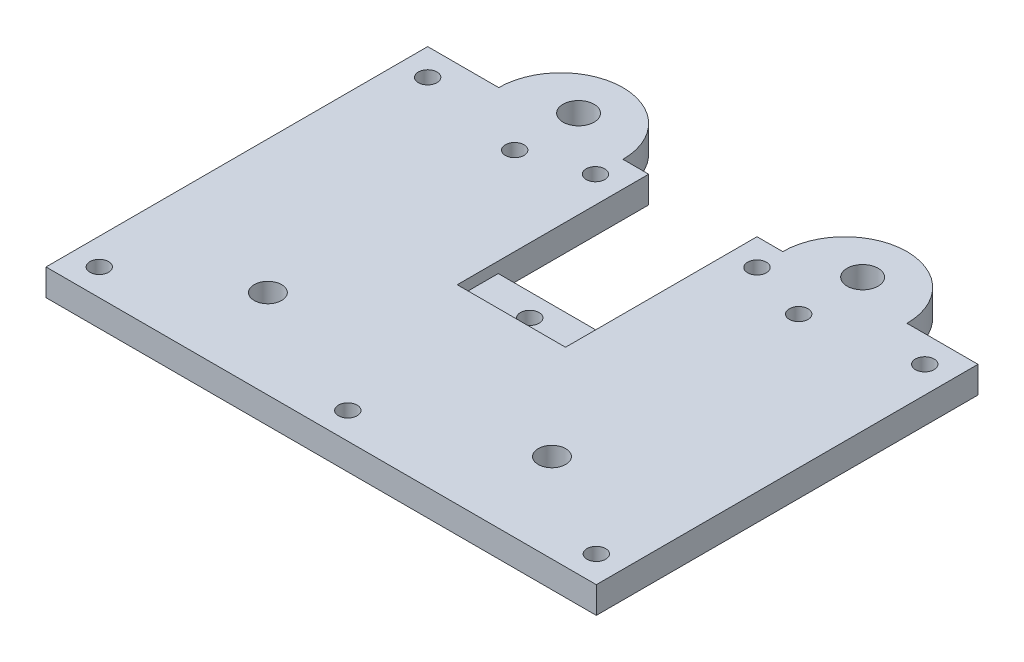
ISO-10303-21;
HEADER;
FILE_DESCRIPTION(('STEP AP214'),'2;1');
FILE_NAME('part.step','',(''),(''),'','','');
FILE_SCHEMA(('AUTOMOTIVE_DESIGN { 1 0 10303 214 1 1 1 1 }'));
ENDSEC;
DATA;
#1=APPLICATION_CONTEXT('core data for automotive mechanical design processes');
#2=APPLICATION_PROTOCOL_DEFINITION('international standard','automotive_design',2000,#1);
#3=PRODUCT_CONTEXT('',#1,'mechanical');
#4=PRODUCT('Part','Part','',(#3));
#5=PRODUCT_RELATED_PRODUCT_CATEGORY('part','',(#4));
#6=PRODUCT_DEFINITION_FORMATION('','',#4);
#7=PRODUCT_DEFINITION_CONTEXT('part definition',#1,'design');
#8=PRODUCT_DEFINITION('design','',#6,#7);
#9=PRODUCT_DEFINITION_SHAPE('','',#8);
#10=(LENGTH_UNIT() NAMED_UNIT(*) SI_UNIT(.MILLI.,.METRE.));
#11=(NAMED_UNIT(*) PLANE_ANGLE_UNIT() SI_UNIT($,.RADIAN.));
#12=(NAMED_UNIT(*) SI_UNIT($,.STERADIAN.) SOLID_ANGLE_UNIT());
#13=UNCERTAINTY_MEASURE_WITH_UNIT(LENGTH_MEASURE(1.E-05),#10,'distance_accuracy_value','');
#14=(GEOMETRIC_REPRESENTATION_CONTEXT(3) GLOBAL_UNCERTAINTY_ASSIGNED_CONTEXT((#13)) GLOBAL_UNIT_ASSIGNED_CONTEXT((#10,
#11,#12)) REPRESENTATION_CONTEXT('',''));
#15=CARTESIAN_POINT('',(0.,0.,0.));
#16=DIRECTION('',(0.,0.,1.));
#17=DIRECTION('',(1.,0.,0.));
#18=AXIS2_PLACEMENT_3D('',#15,#16,#17);
#19=CARTESIAN_POINT('',(0.,3.,0.));
#20=DIRECTION('',(0.,1.,0.));
#21=DIRECTION('',(0.,0.,1.));
#22=AXIS2_PLACEMENT_3D('',#19,#20,#21);
#23=PLANE('',#22);
#24=CARTESIAN_POINT('',(15.,3.,-45.));
#25=DIRECTION('',(0.,1.,0.));
#26=DIRECTION('',(0.,0.,1.));
#27=AXIS2_PLACEMENT_3D('',#24,#25,#26);
#28=CIRCLE('',#27,1.75);
#29=CARTESIAN_POINT('',(15.,3.,-43.25));
#30=VERTEX_POINT('',#29);
#31=EDGE_CURVE('E232',#30,#30,#28,.T.);
#32=ORIENTED_EDGE('',*,*,#31,.F.);
#33=EDGE_LOOP('',(#32));
#34=FACE_BOUND('',#33,.T.);
#35=CARTESIAN_POINT('',(47.,3.,-45.));
#36=DIRECTION('',(0.,1.,0.));
#37=DIRECTION('',(0.,0.,1.));
#38=AXIS2_PLACEMENT_3D('',#35,#36,#37);
#39=CIRCLE('',#38,1.75);
#40=CARTESIAN_POINT('',(47.,3.,-43.25));
#41=VERTEX_POINT('',#40);
#42=EDGE_CURVE('E229',#41,#41,#39,.F.);
#43=ORIENTED_EDGE('',*,*,#42,.T.);
#44=EDGE_LOOP('',(#43));
#45=FACE_BOUND('',#44,.T.);
#46=CARTESIAN_POINT('',(40.1,3.,-40.));
#47=DIRECTION('',(0.,1.,0.));
#48=DIRECTION('',(0.,0.,1.));
#49=AXIS2_PLACEMENT_3D('',#46,#47,#48);
#50=CIRCLE('',#49,1.05);
#51=CARTESIAN_POINT('',(40.1,3.,-38.95));
#52=VERTEX_POINT('',#51);
#53=EDGE_CURVE('E226',#52,#52,#50,.F.);
#54=ORIENTED_EDGE('',*,*,#53,.T.);
#55=EDGE_LOOP('',(#54));
#56=FACE_BOUND('',#55,.T.);
#57=CARTESIAN_POINT('',(21.9,3.,-40.));
#58=DIRECTION('',(0.,1.,0.));
#59=DIRECTION('',(0.,0.,1.));
#60=AXIS2_PLACEMENT_3D('',#57,#58,#59);
#61=CIRCLE('',#60,1.05);
#62=CARTESIAN_POINT('',(21.9,3.,-38.95));
#63=VERTEX_POINT('',#62);
#64=EDGE_CURVE('E223',#63,#63,#61,.T.);
#65=ORIENTED_EDGE('',*,*,#64,.F.);
#66=EDGE_LOOP('',(#65));
#67=FACE_BOUND('',#66,.T.);
#68=CARTESIAN_POINT('',(31.,3.,-3.));
#69=DIRECTION('',(0.,1.,0.));
#70=DIRECTION('',(0.,0.,1.));
#71=AXIS2_PLACEMENT_3D('',#68,#69,#70);
#72=CIRCLE('',#71,1.05);
#73=CARTESIAN_POINT('',(31.,3.,-1.95));
#74=VERTEX_POINT('',#73);
#75=EDGE_CURVE('E220',#74,#74,#72,.T.);
#76=ORIENTED_EDGE('',*,*,#75,.F.);
#77=EDGE_LOOP('',(#76));
#78=FACE_BOUND('',#77,.T.);
#79=CARTESIAN_POINT('',(59.,3.,-40.));
#80=DIRECTION('',(0.,1.,0.));
#81=DIRECTION('',(0.,0.,1.));
#82=AXIS2_PLACEMENT_3D('',#79,#80,#81);
#83=CIRCLE('',#82,1.05);
#84=CARTESIAN_POINT('',(59.,3.,-38.95));
#85=VERTEX_POINT('',#84);
#86=EDGE_CURVE('E217',#85,#85,#83,.F.);
#87=ORIENTED_EDGE('',*,*,#86,.T.);
#88=EDGE_LOOP('',(#87));
#89=FACE_BOUND('',#88,.T.);
#90=CARTESIAN_POINT('',(59.,3.,-3.));
#91=DIRECTION('',(0.,1.,0.));
#92=DIRECTION('',(0.,0.,1.));
#93=AXIS2_PLACEMENT_3D('',#90,#91,#92);
#94=CIRCLE('',#93,1.05);
#95=CARTESIAN_POINT('',(59.,3.,-1.95));
#96=VERTEX_POINT('',#95);
#97=EDGE_CURVE('E214',#96,#96,#94,.T.);
#98=ORIENTED_EDGE('',*,*,#97,.F.);
#99=EDGE_LOOP('',(#98));
#100=FACE_BOUND('',#99,.T.);
#101=CARTESIAN_POINT('',(47.,3.,-10.));
#102=DIRECTION('',(0.,1.,0.));
#103=DIRECTION('',(0.,0.,1.));
#104=AXIS2_PLACEMENT_3D('',#101,#102,#103);
#105=CIRCLE('',#104,1.55);
#106=CARTESIAN_POINT('',(47.,3.,-8.45));
#107=VERTEX_POINT('',#106);
#108=EDGE_CURVE('E211',#107,#107,#105,.F.);
#109=ORIENTED_EDGE('',*,*,#108,.T.);
#110=EDGE_LOOP('',(#109));
#111=FACE_BOUND('',#110,.T.);
#112=CARTESIAN_POINT('',(15.,3.,-10.));
#113=DIRECTION('',(0.,1.,0.));
#114=DIRECTION('',(0.,0.,1.));
#115=AXIS2_PLACEMENT_3D('',#112,#113,#114);
#116=CIRCLE('',#115,1.55);
#117=CARTESIAN_POINT('',(15.,3.,-8.45));
#118=VERTEX_POINT('',#117);
#119=EDGE_CURVE('E208',#118,#118,#116,.T.);
#120=ORIENTED_EDGE('',*,*,#119,.F.);
#121=EDGE_LOOP('',(#120));
#122=FACE_BOUND('',#121,.T.);
#123=CARTESIAN_POINT('',(3.,3.,-40.));
#124=DIRECTION('',(0.,1.,0.));
#125=DIRECTION('',(0.,0.,1.));
#126=AXIS2_PLACEMENT_3D('',#123,#124,#125);
#127=CIRCLE('',#126,1.05);
#128=CARTESIAN_POINT('',(3.,3.,-38.95));
#129=VERTEX_POINT('',#128);
#130=EDGE_CURVE('E186',#129,#129,#127,.T.);
#131=ORIENTED_EDGE('',*,*,#130,.F.);
#132=EDGE_LOOP('',(#131));
#133=FACE_BOUND('',#132,.T.);
#134=CARTESIAN_POINT('',(3.,3.,-3.));
#135=DIRECTION('',(0.,1.,0.));
#136=DIRECTION('',(0.,0.,1.));
#137=AXIS2_PLACEMENT_3D('',#134,#135,#136);
#138=CIRCLE('',#137,1.05);
#139=CARTESIAN_POINT('',(3.,3.,-1.95));
#140=VERTEX_POINT('',#139);
#141=EDGE_CURVE('E183',#140,#140,#138,.F.);
#142=ORIENTED_EDGE('',*,*,#141,.T.);
#143=EDGE_LOOP('',(#142));
#144=FACE_BOUND('',#143,.T.);
#145=CARTESIAN_POINT('',(15.,3.,-37.8));
#146=DIRECTION('',(0.,1.,0.));
#147=DIRECTION('',(0.,0.,1.));
#148=AXIS2_PLACEMENT_3D('',#145,#146,#147);
#149=CIRCLE('',#148,1.05);
#150=CARTESIAN_POINT('',(15.,3.,-36.75));
#151=VERTEX_POINT('',#150);
#152=EDGE_CURVE('E179',#151,#151,#149,.T.);
#153=ORIENTED_EDGE('',*,*,#152,.F.);
#154=EDGE_LOOP('',(#153));
#155=FACE_BOUND('',#154,.T.);
#156=CARTESIAN_POINT('',(47.,3.,-37.8));
#157=DIRECTION('',(0.,1.,0.));
#158=DIRECTION('',(0.,0.,1.));
#159=AXIS2_PLACEMENT_3D('',#156,#157,#158);
#160=CIRCLE('',#159,1.05);
#161=CARTESIAN_POINT('',(47.,3.,-36.75));
#162=VERTEX_POINT('',#161);
#163=EDGE_CURVE('E176',#162,#162,#160,.F.);
#164=ORIENTED_EDGE('',*,*,#163,.T.);
#165=EDGE_LOOP('',(#164));
#166=FACE_BOUND('',#165,.T.);
#167=DIRECTION('',(-1.,0.,0.));
#168=VECTOR('',#167,1.);
#169=CARTESIAN_POINT('',(0.,3.,-21.43));
#170=LINE('',#169,#168);
#171=CARTESIAN_POINT('',(37.1,3.,-21.43));
#172=VERTEX_POINT('',#171);
#173=CARTESIAN_POINT('',(24.9,3.,-21.43));
#174=VERTEX_POINT('',#173);
#175=EDGE_CURVE('E11',#172,#174,#170,.T.);
#176=ORIENTED_EDGE('',*,*,#175,.T.);
#177=DIRECTION('',(0.,0.,1.));
#178=VECTOR('',#177,1.);
#179=CARTESIAN_POINT('',(24.9,3.,-43.));
#180=LINE('',#179,#178);
#181=CARTESIAN_POINT('',(24.9,3.,-43.));
#182=VERTEX_POINT('',#181);
#183=EDGE_CURVE('E142',#182,#174,#180,.T.);
#184=ORIENTED_EDGE('',*,*,#183,.F.);
#185=DIRECTION('',(1.,0.,0.));
#186=VECTOR('',#185,1.);
#187=CARTESIAN_POINT('',(0.,3.,-43.));
#188=LINE('',#187,#186);
#189=CARTESIAN_POINT('',(22.,3.,-43.));
#190=VERTEX_POINT('',#189);
#191=EDGE_CURVE('E199',#190,#182,#188,.T.);
#192=ORIENTED_EDGE('',*,*,#191,.F.);
#193=CARTESIAN_POINT('',(15.,3.,-43.));
#194=DIRECTION('',(0.,1.,0.));
#195=DIRECTION('',(0.,0.,1.));
#196=AXIS2_PLACEMENT_3D('',#193,#194,#195);
#197=CIRCLE('',#196,7.);
#198=CARTESIAN_POINT('',(8.,3.,-43.));
#199=VERTEX_POINT('',#198);
#200=EDGE_CURVE('E202',#190,#199,#197,.T.);
#201=ORIENTED_EDGE('',*,*,#200,.T.);
#202=CARTESIAN_POINT('',(0.,3.,-43.));
#203=VERTEX_POINT('',#202);
#204=EDGE_CURVE('E204',#203,#199,#188,.T.);
#205=ORIENTED_EDGE('',*,*,#204,.F.);
#206=DIRECTION('',(0.,0.,-1.));
#207=VECTOR('',#206,1.);
#208=CARTESIAN_POINT('',(0.,3.,0.));
#209=LINE('',#208,#207);
#210=CARTESIAN_POINT('',(0.,3.,0.));
#211=VERTEX_POINT('',#210);
#212=EDGE_CURVE('E205',#211,#203,#209,.T.);
#213=ORIENTED_EDGE('',*,*,#212,.F.);
#214=DIRECTION('',(1.,0.,0.));
#215=VECTOR('',#214,1.);
#216=CARTESIAN_POINT('',(0.,3.,0.));
#217=LINE('',#216,#215);
#218=CARTESIAN_POINT('',(62.,3.,0.));
#219=VERTEX_POINT('',#218);
#220=EDGE_CURVE('E189',#211,#219,#217,.T.);
#221=ORIENTED_EDGE('',*,*,#220,.T.);
#222=DIRECTION('',(0.,0.,-1.));
#223=VECTOR('',#222,1.);
#224=CARTESIAN_POINT('',(62.,3.,0.));
#225=LINE('',#224,#223);
#226=CARTESIAN_POINT('',(62.,3.,-43.));
#227=VERTEX_POINT('',#226);
#228=EDGE_CURVE('E192',#219,#227,#225,.T.);
#229=ORIENTED_EDGE('',*,*,#228,.T.);
#230=CARTESIAN_POINT('',(54.,3.,-43.));
#231=VERTEX_POINT('',#230);
#232=EDGE_CURVE('E194',#231,#227,#188,.T.);
#233=ORIENTED_EDGE('',*,*,#232,.F.);
#234=CARTESIAN_POINT('',(47.,3.,-43.));
#235=DIRECTION('',(0.,1.,0.));
#236=DIRECTION('',(0.,0.,1.));
#237=AXIS2_PLACEMENT_3D('',#234,#235,#236);
#238=CIRCLE('',#237,7.);
#239=CARTESIAN_POINT('',(40.,3.,-43.));
#240=VERTEX_POINT('',#239);
#241=EDGE_CURVE('E197',#240,#231,#238,.F.);
#242=ORIENTED_EDGE('',*,*,#241,.F.);
#243=CARTESIAN_POINT('',(37.1,3.,-43.));
#244=VERTEX_POINT('',#243);
#245=EDGE_CURVE('E198',#244,#240,#188,.T.);
#246=ORIENTED_EDGE('',*,*,#245,.F.);
#247=DIRECTION('',(0.,0.,-1.));
#248=VECTOR('',#247,1.);
#249=CARTESIAN_POINT('',(37.1,3.,-26.05));
#250=LINE('',#249,#248);
#251=EDGE_CURVE('E164',#172,#244,#250,.T.);
#252=ORIENTED_EDGE('',*,*,#251,.F.);
#253=EDGE_LOOP('',(#176,#184,#192,#201,#205,#213,#221,#229,#233,#242,#246,#252));
#254=FACE_BOUND('',#253,.T.);
#255=ADVANCED_FACE('F37',(#34,#45,#56,#67,#78,#89,#100,#111,#122,#133,#144,#155,#166,#254),#23,.T.);
#256=CARTESIAN_POINT('',(0.,3.,-43.));
#257=DIRECTION('',(0.,0.,-1.));
#258=DIRECTION('',(-1.,0.,0.));
#259=AXIS2_PLACEMENT_3D('',#256,#257,#258);
#260=PLANE('',#259);
#261=DIRECTION('',(0.,1.,0.));
#262=VECTOR('',#261,1.);
#263=CARTESIAN_POINT('',(37.1,-7.,-43.));
#264=LINE('',#263,#262);
#265=CARTESIAN_POINT('',(37.1,0.,-43.));
#266=VERTEX_POINT('',#265);
#267=EDGE_CURVE('E167',#266,#244,#264,.T.);
#268=ORIENTED_EDGE('',*,*,#267,.T.);
#269=ORIENTED_EDGE('',*,*,#245,.T.);
#270=DIRECTION('',(0.,-1.,0.));
#271=VECTOR('',#270,1.);
#272=CARTESIAN_POINT('',(40.,3.,-43.));
#273=LINE('',#272,#271);
#274=CARTESIAN_POINT('',(40.,0.,-43.));
#275=VERTEX_POINT('',#274);
#276=EDGE_CURVE('E304',#240,#275,#273,.T.);
#277=ORIENTED_EDGE('',*,*,#276,.T.);
#278=DIRECTION('',(1.,0.,0.));
#279=VECTOR('',#278,1.);
#280=CARTESIAN_POINT('',(0.,0.,-43.));
#281=LINE('',#280,#279);
#282=EDGE_CURVE('E257',#266,#275,#281,.T.);
#283=ORIENTED_EDGE('',*,*,#282,.F.);
#284=EDGE_LOOP('',(#268,#269,#277,#283));
#285=FACE_BOUND('',#284,.T.);
#286=ADVANCED_FACE('F327',(#285),#260,.T.);
#287=CARTESIAN_POINT('',(0.,3.,0.));
#288=DIRECTION('',(0.,0.,-1.));
#289=DIRECTION('',(-1.,0.,0.));
#290=AXIS2_PLACEMENT_3D('',#287,#288,#289);
#291=PLANE('',#290);
#292=DIRECTION('',(1.,0.,0.));
#293=VECTOR('',#292,1.);
#294=CARTESIAN_POINT('',(0.,0.,0.));
#295=LINE('',#294,#293);
#296=CARTESIAN_POINT('',(0.,0.,0.));
#297=VERTEX_POINT('',#296);
#298=CARTESIAN_POINT('',(62.,0.,0.));
#299=VERTEX_POINT('',#298);
#300=EDGE_CURVE('E247',#297,#299,#295,.T.);
#301=ORIENTED_EDGE('',*,*,#300,.T.);
#302=DIRECTION('',(0.,-1.,0.));
#303=VECTOR('',#302,1.);
#304=CARTESIAN_POINT('',(62.,3.,0.));
#305=LINE('',#304,#303);
#306=EDGE_CURVE('E311',#219,#299,#305,.T.);
#307=ORIENTED_EDGE('',*,*,#306,.F.);
#308=ORIENTED_EDGE('',*,*,#220,.F.);
#309=DIRECTION('',(0.,-1.,0.));
#310=VECTOR('',#309,1.);
#311=CARTESIAN_POINT('',(0.,3.,0.));
#312=LINE('',#311,#310);
#313=EDGE_CURVE('E235',#211,#297,#312,.T.);
#314=ORIENTED_EDGE('',*,*,#313,.T.);
#315=EDGE_LOOP('',(#301,#307,#308,#314));
#316=FACE_BOUND('',#315,.T.);
#317=ADVANCED_FACE('F369',(#316),#291,.F.);
#318=CARTESIAN_POINT('',(62.,3.,0.));
#319=DIRECTION('',(-1.,0.,0.));
#320=DIRECTION('',(0.,0.,1.));
#321=AXIS2_PLACEMENT_3D('',#318,#319,#320);
#322=PLANE('',#321);
#323=DIRECTION('',(0.,0.,-1.));
#324=VECTOR('',#323,1.);
#325=CARTESIAN_POINT('',(62.,0.,0.));
#326=LINE('',#325,#324);
#327=CARTESIAN_POINT('',(62.,0.,-43.));
#328=VERTEX_POINT('',#327);
#329=EDGE_CURVE('E250',#299,#328,#326,.T.);
#330=ORIENTED_EDGE('',*,*,#329,.T.);
#331=DIRECTION('',(0.,-1.,0.));
#332=VECTOR('',#331,1.);
#333=CARTESIAN_POINT('',(62.,3.,-43.));
#334=LINE('',#333,#332);
#335=EDGE_CURVE('E309',#227,#328,#334,.T.);
#336=ORIENTED_EDGE('',*,*,#335,.F.);
#337=ORIENTED_EDGE('',*,*,#228,.F.);
#338=ORIENTED_EDGE('',*,*,#306,.T.);
#339=EDGE_LOOP('',(#330,#336,#337,#338));
#340=FACE_BOUND('',#339,.T.);
#341=ADVANCED_FACE('F430',(#340),#322,.F.);
#342=CARTESIAN_POINT('',(54.,0.,-43.));
#343=VERTEX_POINT('',#342);
#344=EDGE_CURVE('E253',#343,#328,#281,.T.);
#345=ORIENTED_EDGE('',*,*,#344,.F.);
#346=DIRECTION('',(0.,-1.,0.));
#347=VECTOR('',#346,1.);
#348=CARTESIAN_POINT('',(54.,3.,-43.));
#349=LINE('',#348,#347);
#350=EDGE_CURVE('E307',#231,#343,#349,.T.);
#351=ORIENTED_EDGE('',*,*,#350,.F.);
#352=ORIENTED_EDGE('',*,*,#232,.T.);
#353=ORIENTED_EDGE('',*,*,#335,.T.);
#354=EDGE_LOOP('',(#345,#351,#352,#353));
#355=FACE_BOUND('',#354,.T.);
#356=ADVANCED_FACE('F371',(#355),#260,.T.);
#357=CARTESIAN_POINT('',(47.,3.,-43.));
#358=DIRECTION('',(0.,-1.,0.));
#359=DIRECTION('',(0.,0.,-1.));
#360=AXIS2_PLACEMENT_3D('',#357,#358,#359);
#361=CYLINDRICAL_SURFACE('',#360,7.);
#362=CARTESIAN_POINT('',(47.,0.,-43.));
#363=DIRECTION('',(0.,1.,0.));
#364=DIRECTION('',(0.,0.,1.));
#365=AXIS2_PLACEMENT_3D('',#362,#363,#364);
#366=CIRCLE('',#365,7.);
#367=EDGE_CURVE('E256',#275,#343,#366,.F.);
#368=ORIENTED_EDGE('',*,*,#367,.F.);
#369=ORIENTED_EDGE('',*,*,#276,.F.);
#370=ORIENTED_EDGE('',*,*,#241,.T.);
#371=ORIENTED_EDGE('',*,*,#350,.T.);
#372=EDGE_LOOP('',(#368,#369,#370,#371));
#373=FACE_BOUND('',#372,.T.);
#374=ADVANCED_FACE('F426',(#373),#361,.T.);
#375=DIRECTION('',(0.,1.,0.));
#376=VECTOR('',#375,1.);
#377=CARTESIAN_POINT('',(24.9,-7.,-43.));
#378=LINE('',#377,#376);
#379=CARTESIAN_POINT('',(24.9,0.,-43.));
#380=VERTEX_POINT('',#379);
#381=EDGE_CURVE('E166',#380,#182,#378,.T.);
#382=ORIENTED_EDGE('',*,*,#381,.F.);
#383=CARTESIAN_POINT('',(22.,0.,-43.));
#384=VERTEX_POINT('',#383);
#385=EDGE_CURVE('E258',#384,#380,#281,.T.);
#386=ORIENTED_EDGE('',*,*,#385,.F.);
#387=DIRECTION('',(0.,-1.,0.));
#388=VECTOR('',#387,1.);
#389=CARTESIAN_POINT('',(22.,3.,-43.));
#390=LINE('',#389,#388);
#391=EDGE_CURVE('E302',#190,#384,#390,.T.);
#392=ORIENTED_EDGE('',*,*,#391,.F.);
#393=ORIENTED_EDGE('',*,*,#191,.T.);
#394=EDGE_LOOP('',(#382,#386,#392,#393));
#395=FACE_BOUND('',#394,.T.);
#396=ADVANCED_FACE('F350',(#395),#260,.T.);
#397=CARTESIAN_POINT('',(15.,3.,-43.));
#398=DIRECTION('',(0.,-1.,0.));
#399=DIRECTION('',(0.,0.,-1.));
#400=AXIS2_PLACEMENT_3D('',#397,#398,#399);
#401=CYLINDRICAL_SURFACE('',#400,7.);
#402=CARTESIAN_POINT('',(15.,0.,-43.));
#403=DIRECTION('',(0.,1.,0.));
#404=DIRECTION('',(0.,0.,1.));
#405=AXIS2_PLACEMENT_3D('',#402,#403,#404);
#406=CIRCLE('',#405,7.);
#407=CARTESIAN_POINT('',(8.,0.,-43.));
#408=VERTEX_POINT('',#407);
#409=EDGE_CURVE('E261',#384,#408,#406,.T.);
#410=ORIENTED_EDGE('',*,*,#409,.T.);
#411=DIRECTION('',(0.,-1.,0.));
#412=VECTOR('',#411,1.);
#413=CARTESIAN_POINT('',(8.,3.,-43.));
#414=LINE('',#413,#412);
#415=EDGE_CURVE('E300',#199,#408,#414,.T.);
#416=ORIENTED_EDGE('',*,*,#415,.F.);
#417=ORIENTED_EDGE('',*,*,#200,.F.);
#418=ORIENTED_EDGE('',*,*,#391,.T.);
#419=EDGE_LOOP('',(#410,#416,#417,#418));
#420=FACE_BOUND('',#419,.T.);
#421=ADVANCED_FACE('F345',(#420),#401,.T.);
#422=CARTESIAN_POINT('',(0.,0.,-43.));
#423=VERTEX_POINT('',#422);
#424=EDGE_CURVE('E264',#423,#408,#281,.T.);
#425=ORIENTED_EDGE('',*,*,#424,.F.);
#426=DIRECTION('',(0.,-1.,0.));
#427=VECTOR('',#426,1.);
#428=CARTESIAN_POINT('',(0.,3.,-43.));
#429=LINE('',#428,#427);
#430=EDGE_CURVE('E298',#203,#423,#429,.T.);
#431=ORIENTED_EDGE('',*,*,#430,.F.);
#432=ORIENTED_EDGE('',*,*,#204,.T.);
#433=ORIENTED_EDGE('',*,*,#415,.T.);
#434=EDGE_LOOP('',(#425,#431,#432,#433));
#435=FACE_BOUND('',#434,.T.);
#436=ADVANCED_FACE('F339',(#435),#260,.T.);
#437=CARTESIAN_POINT('',(47.,3.,-45.));
#438=DIRECTION('',(0.,-1.,0.));
#439=DIRECTION('',(0.,0.,-1.));
#440=AXIS2_PLACEMENT_3D('',#437,#438,#439);
#441=CYLINDRICAL_SURFACE('',#440,1.75);
#442=ORIENTED_EDGE('',*,*,#42,.F.);
#443=EDGE_LOOP('',(#442));
#444=FACE_BOUND('',#443,.T.);
#445=CARTESIAN_POINT('',(47.,0.,-45.));
#446=DIRECTION('',(0.,1.,0.));
#447=DIRECTION('',(0.,0.,1.));
#448=AXIS2_PLACEMENT_3D('',#445,#446,#447);
#449=CIRCLE('',#448,1.75);
#450=CARTESIAN_POINT('',(47.,0.,-43.25));
#451=VERTEX_POINT('',#450);
#452=EDGE_CURVE('E292',#451,#451,#449,.F.);
#453=ORIENTED_EDGE('',*,*,#452,.T.);
#454=EDGE_LOOP('',(#453));
#455=FACE_BOUND('',#454,.T.);
#456=ADVANCED_FACE('F382',(#444,#455),#441,.F.);
#457=CARTESIAN_POINT('',(40.1,3.,-40.));
#458=DIRECTION('',(0.,-1.,0.));
#459=DIRECTION('',(0.,0.,-1.));
#460=AXIS2_PLACEMENT_3D('',#457,#458,#459);
#461=CYLINDRICAL_SURFACE('',#460,1.05);
#462=ORIENTED_EDGE('',*,*,#53,.F.);
#463=EDGE_LOOP('',(#462));
#464=FACE_BOUND('',#463,.T.);
#465=CARTESIAN_POINT('',(40.1,0.,-40.));
#466=DIRECTION('',(0.,1.,0.));
#467=DIRECTION('',(0.,0.,1.));
#468=AXIS2_PLACEMENT_3D('',#465,#466,#467);
#469=CIRCLE('',#468,1.05);
#470=CARTESIAN_POINT('',(40.1,0.,-38.95));
#471=VERTEX_POINT('',#470);
#472=EDGE_CURVE('E289',#471,#471,#469,.F.);
#473=ORIENTED_EDGE('',*,*,#472,.T.);
#474=EDGE_LOOP('',(#473));
#475=FACE_BOUND('',#474,.T.);
#476=ADVANCED_FACE('F385',(#464,#475),#461,.F.);
#477=CARTESIAN_POINT('',(21.9,3.,-40.));
#478=DIRECTION('',(0.,-1.,0.));
#479=DIRECTION('',(0.,0.,-1.));
#480=AXIS2_PLACEMENT_3D('',#477,#478,#479);
#481=CYLINDRICAL_SURFACE('',#480,1.05);
#482=ORIENTED_EDGE('',*,*,#64,.T.);
#483=EDGE_LOOP('',(#482));
#484=FACE_BOUND('',#483,.T.);
#485=CARTESIAN_POINT('',(21.9,0.,-40.));
#486=DIRECTION('',(0.,1.,0.));
#487=DIRECTION('',(0.,0.,1.));
#488=AXIS2_PLACEMENT_3D('',#485,#486,#487);
#489=CIRCLE('',#488,1.05);
#490=CARTESIAN_POINT('',(21.9,0.,-38.95));
#491=VERTEX_POINT('',#490);
#492=EDGE_CURVE('E286',#491,#491,#489,.T.);
#493=ORIENTED_EDGE('',*,*,#492,.F.);
#494=EDGE_LOOP('',(#493));
#495=FACE_BOUND('',#494,.T.);
#496=ADVANCED_FACE('F389',(#484,#495),#481,.F.);
#497=CARTESIAN_POINT('',(31.,3.,-23.5));
#498=DIRECTION('',(0.,-1.,0.));
#499=DIRECTION('',(0.,0.,-1.));
#500=AXIS2_PLACEMENT_3D('',#497,#498,#499);
#501=CYLINDRICAL_SURFACE('',#500,1.05);
#502=CARTESIAN_POINT('',(31.,1.78,-23.5));
#503=DIRECTION('',(0.,-1.,0.));
#504=DIRECTION('',(0.,0.,-1.));
#505=AXIS2_PLACEMENT_3D('',#502,#503,#504);
#506=CIRCLE('',#505,1.05);
#507=CARTESIAN_POINT('',(31.,1.78,-24.55));
#508=VERTEX_POINT('',#507);
#509=EDGE_CURVE('E145',#508,#508,#506,.T.);
#510=ORIENTED_EDGE('',*,*,#509,.F.);
#511=EDGE_LOOP('',(#510));
#512=FACE_BOUND('',#511,.T.);
#513=CARTESIAN_POINT('',(31.,0.,-23.5));
#514=DIRECTION('',(0.,1.,0.));
#515=DIRECTION('',(0.,0.,1.));
#516=AXIS2_PLACEMENT_3D('',#513,#514,#515);
#517=CIRCLE('',#516,1.05);
#518=CARTESIAN_POINT('',(31.,0.,-22.45));
#519=VERTEX_POINT('',#518);
#520=EDGE_CURVE('E283',#519,#519,#517,.T.);
#521=ORIENTED_EDGE('',*,*,#520,.F.);
#522=EDGE_LOOP('',(#521));
#523=FACE_BOUND('',#522,.T.);
#524=ADVANCED_FACE('F393',(#512,#523),#501,.F.);
#525=CARTESIAN_POINT('',(31.,3.,-3.));
#526=DIRECTION('',(0.,-1.,0.));
#527=DIRECTION('',(0.,0.,-1.));
#528=AXIS2_PLACEMENT_3D('',#525,#526,#527);
#529=CYLINDRICAL_SURFACE('',#528,1.05);
#530=ORIENTED_EDGE('',*,*,#75,.T.);
#531=EDGE_LOOP('',(#530));
#532=FACE_BOUND('',#531,.T.);
#533=CARTESIAN_POINT('',(31.,0.,-3.));
#534=DIRECTION('',(0.,1.,0.));
#535=DIRECTION('',(0.,0.,1.));
#536=AXIS2_PLACEMENT_3D('',#533,#534,#535);
#537=CIRCLE('',#536,1.05);
#538=CARTESIAN_POINT('',(31.,0.,-1.95));
#539=VERTEX_POINT('',#538);
#540=EDGE_CURVE('E280',#539,#539,#537,.T.);
#541=ORIENTED_EDGE('',*,*,#540,.F.);
#542=EDGE_LOOP('',(#541));
#543=FACE_BOUND('',#542,.T.);
#544=ADVANCED_FACE('F397',(#532,#543),#529,.F.);
#545=CARTESIAN_POINT('',(59.,3.,-40.));
#546=DIRECTION('',(0.,-1.,0.));
#547=DIRECTION('',(0.,0.,-1.));
#548=AXIS2_PLACEMENT_3D('',#545,#546,#547);
#549=CYLINDRICAL_SURFACE('',#548,1.05);
#550=ORIENTED_EDGE('',*,*,#86,.F.);
#551=EDGE_LOOP('',(#550));
#552=FACE_BOUND('',#551,.T.);
#553=CARTESIAN_POINT('',(59.,0.,-40.));
#554=DIRECTION('',(0.,1.,0.));
#555=DIRECTION('',(0.,0.,1.));
#556=AXIS2_PLACEMENT_3D('',#553,#554,#555);
#557=CIRCLE('',#556,1.05);
#558=CARTESIAN_POINT('',(59.,0.,-38.95));
#559=VERTEX_POINT('',#558);
#560=EDGE_CURVE('E277',#559,#559,#557,.F.);
#561=ORIENTED_EDGE('',*,*,#560,.T.);
#562=EDGE_LOOP('',(#561));
#563=FACE_BOUND('',#562,.T.);
#564=ADVANCED_FACE('F401',(#552,#563),#549,.F.);
#565=CARTESIAN_POINT('',(59.,3.,-3.));
#566=DIRECTION('',(0.,-1.,0.));
#567=DIRECTION('',(0.,0.,-1.));
#568=AXIS2_PLACEMENT_3D('',#565,#566,#567);
#569=CYLINDRICAL_SURFACE('',#568,1.05);
#570=ORIENTED_EDGE('',*,*,#97,.T.);
#571=EDGE_LOOP('',(#570));
#572=FACE_BOUND('',#571,.T.);
#573=CARTESIAN_POINT('',(59.,0.,-3.));
#574=DIRECTION('',(0.,1.,0.));
#575=DIRECTION('',(0.,0.,1.));
#576=AXIS2_PLACEMENT_3D('',#573,#574,#575);
#577=CIRCLE('',#576,1.05);
#578=CARTESIAN_POINT('',(59.,0.,-1.95));
#579=VERTEX_POINT('',#578);
#580=EDGE_CURVE('E274',#579,#579,#577,.T.);
#581=ORIENTED_EDGE('',*,*,#580,.F.);
#582=EDGE_LOOP('',(#581));
#583=FACE_BOUND('',#582,.T.);
#584=ADVANCED_FACE('F405',(#572,#583),#569,.F.);
#585=CARTESIAN_POINT('',(47.,3.,-10.));
#586=DIRECTION('',(0.,-1.,0.));
#587=DIRECTION('',(0.,0.,-1.));
#588=AXIS2_PLACEMENT_3D('',#585,#586,#587);
#589=CYLINDRICAL_SURFACE('',#588,1.55);
#590=ORIENTED_EDGE('',*,*,#108,.F.);
#591=EDGE_LOOP('',(#590));
#592=FACE_BOUND('',#591,.T.);
#593=CARTESIAN_POINT('',(47.,0.,-10.));
#594=DIRECTION('',(0.,1.,0.));
#595=DIRECTION('',(0.,0.,1.));
#596=AXIS2_PLACEMENT_3D('',#593,#594,#595);
#597=CIRCLE('',#596,1.55);
#598=CARTESIAN_POINT('',(47.,0.,-8.45));
#599=VERTEX_POINT('',#598);
#600=EDGE_CURVE('E271',#599,#599,#597,.F.);
#601=ORIENTED_EDGE('',*,*,#600,.T.);
#602=EDGE_LOOP('',(#601));
#603=FACE_BOUND('',#602,.T.);
#604=ADVANCED_FACE('F409',(#592,#603),#589,.F.);
#605=CARTESIAN_POINT('',(15.,3.,-10.));
#606=DIRECTION('',(0.,-1.,0.));
#607=DIRECTION('',(0.,0.,-1.));
#608=AXIS2_PLACEMENT_3D('',#605,#606,#607);
#609=CYLINDRICAL_SURFACE('',#608,1.55);
#610=ORIENTED_EDGE('',*,*,#119,.T.);
#611=EDGE_LOOP('',(#610));
#612=FACE_BOUND('',#611,.T.);
#613=CARTESIAN_POINT('',(15.,0.,-10.));
#614=DIRECTION('',(0.,1.,0.));
#615=DIRECTION('',(0.,0.,1.));
#616=AXIS2_PLACEMENT_3D('',#613,#614,#615);
#617=CIRCLE('',#616,1.55);
#618=CARTESIAN_POINT('',(15.,0.,-8.45));
#619=VERTEX_POINT('',#618);
#620=EDGE_CURVE('E268',#619,#619,#617,.T.);
#621=ORIENTED_EDGE('',*,*,#620,.F.);
#622=EDGE_LOOP('',(#621));
#623=FACE_BOUND('',#622,.T.);
#624=ADVANCED_FACE('F413',(#612,#623),#609,.F.);
#625=CARTESIAN_POINT('',(0.,3.,0.));
#626=DIRECTION('',(-1.,0.,0.));
#627=DIRECTION('',(0.,0.,1.));
#628=AXIS2_PLACEMENT_3D('',#625,#626,#627);
#629=PLANE('',#628);
#630=DIRECTION('',(0.,0.,-1.));
#631=VECTOR('',#630,1.);
#632=CARTESIAN_POINT('',(0.,0.,0.));
#633=LINE('',#632,#631);
#634=EDGE_CURVE('E265',#297,#423,#633,.T.);
#635=ORIENTED_EDGE('',*,*,#634,.F.);
#636=ORIENTED_EDGE('',*,*,#313,.F.);
#637=ORIENTED_EDGE('',*,*,#212,.T.);
#638=ORIENTED_EDGE('',*,*,#430,.T.);
#639=EDGE_LOOP('',(#635,#636,#637,#638));
#640=FACE_BOUND('',#639,.T.);
#641=ADVANCED_FACE('F417',(#640),#629,.T.);
#642=CARTESIAN_POINT('',(3.,3.,-40.));
#643=DIRECTION('',(0.,-1.,0.));
#644=DIRECTION('',(0.,0.,-1.));
#645=AXIS2_PLACEMENT_3D('',#642,#643,#644);
#646=CYLINDRICAL_SURFACE('',#645,1.05);
#647=ORIENTED_EDGE('',*,*,#130,.T.);
#648=EDGE_LOOP('',(#647));
#649=FACE_BOUND('',#648,.T.);
#650=CARTESIAN_POINT('',(3.,0.,-40.));
#651=DIRECTION('',(0.,1.,0.));
#652=DIRECTION('',(0.,0.,1.));
#653=AXIS2_PLACEMENT_3D('',#650,#651,#652);
#654=CIRCLE('',#653,1.05);
#655=CARTESIAN_POINT('',(3.,0.,-38.95));
#656=VERTEX_POINT('',#655);
#657=EDGE_CURVE('E244',#656,#656,#654,.T.);
#658=ORIENTED_EDGE('',*,*,#657,.F.);
#659=EDGE_LOOP('',(#658));
#660=FACE_BOUND('',#659,.T.);
#661=ADVANCED_FACE('F420',(#649,#660),#646,.F.);
#662=CARTESIAN_POINT('',(3.,3.,-3.));
#663=DIRECTION('',(0.,-1.,0.));
#664=DIRECTION('',(0.,0.,-1.));
#665=AXIS2_PLACEMENT_3D('',#662,#663,#664);
#666=CYLINDRICAL_SURFACE('',#665,1.05);
#667=ORIENTED_EDGE('',*,*,#141,.F.);
#668=EDGE_LOOP('',(#667));
#669=FACE_BOUND('',#668,.T.);
#670=CARTESIAN_POINT('',(3.,0.,-3.));
#671=DIRECTION('',(0.,1.,0.));
#672=DIRECTION('',(0.,0.,1.));
#673=AXIS2_PLACEMENT_3D('',#670,#671,#672);
#674=CIRCLE('',#673,1.05);
#675=CARTESIAN_POINT('',(3.,0.,-1.95));
#676=VERTEX_POINT('',#675);
#677=EDGE_CURVE('E241',#676,#676,#674,.F.);
#678=ORIENTED_EDGE('',*,*,#677,.T.);
#679=EDGE_LOOP('',(#678));
#680=FACE_BOUND('',#679,.T.);
#681=ADVANCED_FACE('F439',(#669,#680),#666,.F.);
#682=CARTESIAN_POINT('',(15.,3.,-37.8));
#683=DIRECTION('',(0.,-1.,0.));
#684=DIRECTION('',(0.,0.,-1.));
#685=AXIS2_PLACEMENT_3D('',#682,#683,#684);
#686=CYLINDRICAL_SURFACE('',#685,1.05);
#687=ORIENTED_EDGE('',*,*,#152,.T.);
#688=EDGE_LOOP('',(#687));
#689=FACE_BOUND('',#688,.T.);
#690=CARTESIAN_POINT('',(15.,0.,-37.8));
#691=DIRECTION('',(0.,1.,0.));
#692=DIRECTION('',(0.,0.,1.));
#693=AXIS2_PLACEMENT_3D('',#690,#691,#692);
#694=CIRCLE('',#693,1.05);
#695=CARTESIAN_POINT('',(15.,0.,-36.75));
#696=VERTEX_POINT('',#695);
#697=EDGE_CURVE('E238',#696,#696,#694,.T.);
#698=ORIENTED_EDGE('',*,*,#697,.F.);
#699=EDGE_LOOP('',(#698));
#700=FACE_BOUND('',#699,.T.);
#701=ADVANCED_FACE('F442',(#689,#700),#686,.F.);
#702=CARTESIAN_POINT('',(47.,3.,-37.8));
#703=DIRECTION('',(0.,-1.,0.));
#704=DIRECTION('',(0.,0.,-1.));
#705=AXIS2_PLACEMENT_3D('',#702,#703,#704);
#706=CYLINDRICAL_SURFACE('',#705,1.05);
#707=ORIENTED_EDGE('',*,*,#163,.F.);
#708=EDGE_LOOP('',(#707));
#709=FACE_BOUND('',#708,.T.);
#710=CARTESIAN_POINT('',(47.,0.,-37.8));
#711=DIRECTION('',(0.,1.,0.));
#712=DIRECTION('',(0.,0.,1.));
#713=AXIS2_PLACEMENT_3D('',#710,#711,#712);
#714=CIRCLE('',#713,1.05);
#715=CARTESIAN_POINT('',(47.,0.,-36.75));
#716=VERTEX_POINT('',#715);
#717=EDGE_CURVE('E170',#716,#716,#714,.F.);
#718=ORIENTED_EDGE('',*,*,#717,.T.);
#719=EDGE_LOOP('',(#718));
#720=FACE_BOUND('',#719,.T.);
#721=ADVANCED_FACE('F39',(#709,#720),#706,.F.);
#722=CARTESIAN_POINT('',(15.,3.,-45.));
#723=DIRECTION('',(0.,-1.,0.));
#724=DIRECTION('',(0.,0.,-1.));
#725=AXIS2_PLACEMENT_3D('',#722,#723,#724);
#726=CYLINDRICAL_SURFACE('',#725,1.75);
#727=ORIENTED_EDGE('',*,*,#31,.T.);
#728=EDGE_LOOP('',(#727));
#729=FACE_BOUND('',#728,.T.);
#730=CARTESIAN_POINT('',(15.,0.,-45.));
#731=DIRECTION('',(0.,1.,0.));
#732=DIRECTION('',(0.,0.,1.));
#733=AXIS2_PLACEMENT_3D('',#730,#731,#732);
#734=CIRCLE('',#733,1.75);
#735=CARTESIAN_POINT('',(15.,0.,-43.25));
#736=VERTEX_POINT('',#735);
#737=EDGE_CURVE('E180',#736,#736,#734,.T.);
#738=ORIENTED_EDGE('',*,*,#737,.F.);
#739=EDGE_LOOP('',(#738));
#740=FACE_BOUND('',#739,.T.);
#741=ADVANCED_FACE('F377',(#729,#740),#726,.F.);
#742=CARTESIAN_POINT('',(0.,0.,0.));
#743=DIRECTION('',(0.,1.,0.));
#744=DIRECTION('',(0.,0.,1.));
#745=AXIS2_PLACEMENT_3D('',#742,#743,#744);
#746=PLANE('',#745);
#747=ORIENTED_EDGE('',*,*,#717,.F.);
#748=EDGE_LOOP('',(#747));
#749=FACE_BOUND('',#748,.T.);
#750=ORIENTED_EDGE('',*,*,#697,.T.);
#751=EDGE_LOOP('',(#750));
#752=FACE_BOUND('',#751,.T.);
#753=ORIENTED_EDGE('',*,*,#677,.F.);
#754=EDGE_LOOP('',(#753));
#755=FACE_BOUND('',#754,.T.);
#756=ORIENTED_EDGE('',*,*,#657,.T.);
#757=EDGE_LOOP('',(#756));
#758=FACE_BOUND('',#757,.T.);
#759=DIRECTION('',(1.,0.,0.));
#760=VECTOR('',#759,1.);
#761=CARTESIAN_POINT('',(0.,0.,-26.05));
#762=LINE('',#761,#760);
#763=CARTESIAN_POINT('',(24.9,0.,-26.05));
#764=VERTEX_POINT('',#763);
#765=CARTESIAN_POINT('',(37.1,0.,-26.05));
#766=VERTEX_POINT('',#765);
#767=EDGE_CURVE('E317',#764,#766,#762,.T.);
#768=ORIENTED_EDGE('',*,*,#767,.T.);
#769=DIRECTION('',(0.,0.,-1.));
#770=VECTOR('',#769,1.);
#771=CARTESIAN_POINT('',(37.1,0.,0.));
#772=LINE('',#771,#770);
#773=EDGE_CURVE('E45',#766,#266,#772,.T.);
#774=ORIENTED_EDGE('',*,*,#773,.T.);
#775=ORIENTED_EDGE('',*,*,#282,.T.);
#776=ORIENTED_EDGE('',*,*,#367,.T.);
#777=ORIENTED_EDGE('',*,*,#344,.T.);
#778=ORIENTED_EDGE('',*,*,#329,.F.);
#779=ORIENTED_EDGE('',*,*,#300,.F.);
#780=ORIENTED_EDGE('',*,*,#634,.T.);
#781=ORIENTED_EDGE('',*,*,#424,.T.);
#782=ORIENTED_EDGE('',*,*,#409,.F.);
#783=ORIENTED_EDGE('',*,*,#385,.T.);
#784=DIRECTION('',(0.,0.,1.));
#785=VECTOR('',#784,1.);
#786=CARTESIAN_POINT('',(24.9,0.,0.));
#787=LINE('',#786,#785);
#788=EDGE_CURVE('E314',#380,#764,#787,.T.);
#789=ORIENTED_EDGE('',*,*,#788,.T.);
#790=EDGE_LOOP('',(#768,#774,#775,#776,#777,#778,#779,#780,#781,#782,#783,#789));
#791=FACE_BOUND('',#790,.T.);
#792=ORIENTED_EDGE('',*,*,#620,.T.);
#793=EDGE_LOOP('',(#792));
#794=FACE_BOUND('',#793,.T.);
#795=ORIENTED_EDGE('',*,*,#600,.F.);
#796=EDGE_LOOP('',(#795));
#797=FACE_BOUND('',#796,.T.);
#798=ORIENTED_EDGE('',*,*,#580,.T.);
#799=EDGE_LOOP('',(#798));
#800=FACE_BOUND('',#799,.T.);
#801=ORIENTED_EDGE('',*,*,#560,.F.);
#802=EDGE_LOOP('',(#801));
#803=FACE_BOUND('',#802,.T.);
#804=ORIENTED_EDGE('',*,*,#540,.T.);
#805=EDGE_LOOP('',(#804));
#806=FACE_BOUND('',#805,.T.);
#807=ORIENTED_EDGE('',*,*,#520,.T.);
#808=EDGE_LOOP('',(#807));
#809=FACE_BOUND('',#808,.T.);
#810=ORIENTED_EDGE('',*,*,#492,.T.);
#811=EDGE_LOOP('',(#810));
#812=FACE_BOUND('',#811,.T.);
#813=ORIENTED_EDGE('',*,*,#472,.F.);
#814=EDGE_LOOP('',(#813));
#815=FACE_BOUND('',#814,.T.);
#816=ORIENTED_EDGE('',*,*,#452,.F.);
#817=EDGE_LOOP('',(#816));
#818=FACE_BOUND('',#817,.T.);
#819=ORIENTED_EDGE('',*,*,#737,.T.);
#820=EDGE_LOOP('',(#819));
#821=FACE_BOUND('',#820,.T.);
#822=ADVANCED_FACE('F322',(#749,#752,#755,#758,#791,#794,#797,#800,#803,#806,#809,#812,#815,
#818,#821),#746,.F.);
#823=CARTESIAN_POINT('',(37.1,-7.,-26.05));
#824=DIRECTION('',(1.,0.,0.));
#825=DIRECTION('',(0.,0.,-1.));
#826=AXIS2_PLACEMENT_3D('',#823,#824,#825);
#827=PLANE('',#826);
#828=DIRECTION('',(0.,1.,0.));
#829=VECTOR('',#828,1.);
#830=CARTESIAN_POINT('',(37.1,-7.,-26.05));
#831=LINE('',#830,#829);
#832=CARTESIAN_POINT('',(37.1,1.78,-26.05));
#833=VERTEX_POINT('',#832);
#834=EDGE_CURVE('E171',#766,#833,#831,.T.);
#835=ORIENTED_EDGE('',*,*,#834,.T.);
#836=DIRECTION('',(0.,0.,-1.));
#837=VECTOR('',#836,1.);
#838=CARTESIAN_POINT('',(37.1,1.78,-26.05));
#839=LINE('',#838,#837);
#840=CARTESIAN_POINT('',(37.1,1.78,-21.43));
#841=VERTEX_POINT('',#840);
#842=EDGE_CURVE('E153',#841,#833,#839,.T.);
#843=ORIENTED_EDGE('',*,*,#842,.F.);
#844=DIRECTION('',(0.,-1.,0.));
#845=VECTOR('',#844,1.);
#846=CARTESIAN_POINT('',(37.1,3.000012,-21.43));
#847=LINE('',#846,#845);
#848=EDGE_CURVE('E146',#172,#841,#847,.T.);
#849=ORIENTED_EDGE('',*,*,#848,.F.);
#850=ORIENTED_EDGE('',*,*,#251,.T.);
#851=ORIENTED_EDGE('',*,*,#267,.F.);
#852=ORIENTED_EDGE('',*,*,#773,.F.);
#853=EDGE_LOOP('',(#835,#843,#849,#850,#851,#852));
#854=FACE_BOUND('',#853,.T.);
#855=ADVANCED_FACE('F352',(#854),#827,.F.);
#856=CARTESIAN_POINT('',(24.9,-7.,-26.05));
#857=DIRECTION('',(0.,0.,1.));
#858=DIRECTION('',(1.,0.,0.));
#859=AXIS2_PLACEMENT_3D('',#856,#857,#858);
#860=PLANE('',#859);
#861=DIRECTION('',(0.,1.,0.));
#862=VECTOR('',#861,1.);
#863=CARTESIAN_POINT('',(24.9,-7.,-26.05));
#864=LINE('',#863,#862);
#865=CARTESIAN_POINT('',(24.9,1.78,-26.05));
#866=VERTEX_POINT('',#865);
#867=EDGE_CURVE('E59',#764,#866,#864,.T.);
#868=ORIENTED_EDGE('',*,*,#867,.T.);
#869=DIRECTION('',(-1.,0.,0.));
#870=VECTOR('',#869,1.);
#871=CARTESIAN_POINT('',(24.9,1.78,-26.05));
#872=LINE('',#871,#870);
#873=EDGE_CURVE('E52',#833,#866,#872,.T.);
#874=ORIENTED_EDGE('',*,*,#873,.F.);
#875=ORIENTED_EDGE('',*,*,#834,.F.);
#876=ORIENTED_EDGE('',*,*,#767,.F.);
#877=EDGE_LOOP('',(#868,#874,#875,#876));
#878=FACE_BOUND('',#877,.T.);
#879=ADVANCED_FACE('F354',(#878),#860,.F.);
#880=CARTESIAN_POINT('',(24.9,-7.,-43.));
#881=DIRECTION('',(-1.,0.,0.));
#882=DIRECTION('',(0.,0.,1.));
#883=AXIS2_PLACEMENT_3D('',#880,#881,#882);
#884=PLANE('',#883);
#885=ORIENTED_EDGE('',*,*,#381,.T.);
#886=ORIENTED_EDGE('',*,*,#183,.T.);
#887=DIRECTION('',(0.,-1.,0.));
#888=VECTOR('',#887,1.);
#889=CARTESIAN_POINT('',(24.9,3.000012,-21.43));
#890=LINE('',#889,#888);
#891=CARTESIAN_POINT('',(24.9,1.78,-21.43));
#892=VERTEX_POINT('',#891);
#893=EDGE_CURVE('E137',#174,#892,#890,.T.);
#894=ORIENTED_EDGE('',*,*,#893,.T.);
#895=DIRECTION('',(0.,0.,1.));
#896=VECTOR('',#895,1.);
#897=CARTESIAN_POINT('',(24.9,1.78,-26.05));
#898=LINE('',#897,#896);
#899=EDGE_CURVE('E140',#866,#892,#898,.T.);
#900=ORIENTED_EDGE('',*,*,#899,.F.);
#901=ORIENTED_EDGE('',*,*,#867,.F.);
#902=ORIENTED_EDGE('',*,*,#788,.F.);
#903=EDGE_LOOP('',(#885,#886,#894,#900,#901,#902));
#904=FACE_BOUND('',#903,.T.);
#905=ADVANCED_FACE('F139',(#904),#884,.F.);
#906=CARTESIAN_POINT('',(24.9,3.000012,-21.43));
#907=DIRECTION('',(0.,0.,-1.));
#908=DIRECTION('',(-1.,0.,0.));
#909=AXIS2_PLACEMENT_3D('',#906,#907,#908);
#910=PLANE('',#909);
#911=ORIENTED_EDGE('',*,*,#848,.T.);
#912=DIRECTION('',(1.,0.,0.));
#913=VECTOR('',#912,1.);
#914=CARTESIAN_POINT('',(24.9,1.78,-21.43));
#915=LINE('',#914,#913);
#916=EDGE_CURVE('E149',#892,#841,#915,.T.);
#917=ORIENTED_EDGE('',*,*,#916,.F.);
#918=ORIENTED_EDGE('',*,*,#893,.F.);
#919=ORIENTED_EDGE('',*,*,#175,.F.);
#920=EDGE_LOOP('',(#911,#917,#918,#919));
#921=FACE_BOUND('',#920,.T.);
#922=ADVANCED_FACE('F150',(#921),#910,.T.);
#923=CARTESIAN_POINT('',(0.,1.78,0.));
#924=DIRECTION('',(0.,-1.,0.));
#925=DIRECTION('',(0.,0.,-1.));
#926=AXIS2_PLACEMENT_3D('',#923,#924,#925);
#927=PLANE('',#926);
#928=ORIENTED_EDGE('',*,*,#509,.T.);
#929=EDGE_LOOP('',(#928));
#930=FACE_BOUND('',#929,.T.);
#931=ORIENTED_EDGE('',*,*,#873,.T.);
#932=ORIENTED_EDGE('',*,*,#899,.T.);
#933=ORIENTED_EDGE('',*,*,#916,.T.);
#934=ORIENTED_EDGE('',*,*,#842,.T.);
#935=EDGE_LOOP('',(#931,#932,#933,#934));
#936=FACE_BOUND('',#935,.T.);
#937=ADVANCED_FACE('F155',(#930,#936),#927,.F.);
#938=CLOSED_SHELL('',(#255,#286,#317,#341,#356,#374,#396,#421,#436,#456,#476,#496,#524,#544,
#564,#584,#604,#624,#641,#661,#681,#701,#721,#741,#822,#855,#879,#905,#922,#937));
#939=MANIFOLD_SOLID_BREP('B2',#938);
#940=ADVANCED_BREP_SHAPE_REPRESENTATION('',(#18,#939),#14);
#941=SHAPE_DEFINITION_REPRESENTATION(#9,#940);
ENDSEC;
END-ISO-10303-21;
